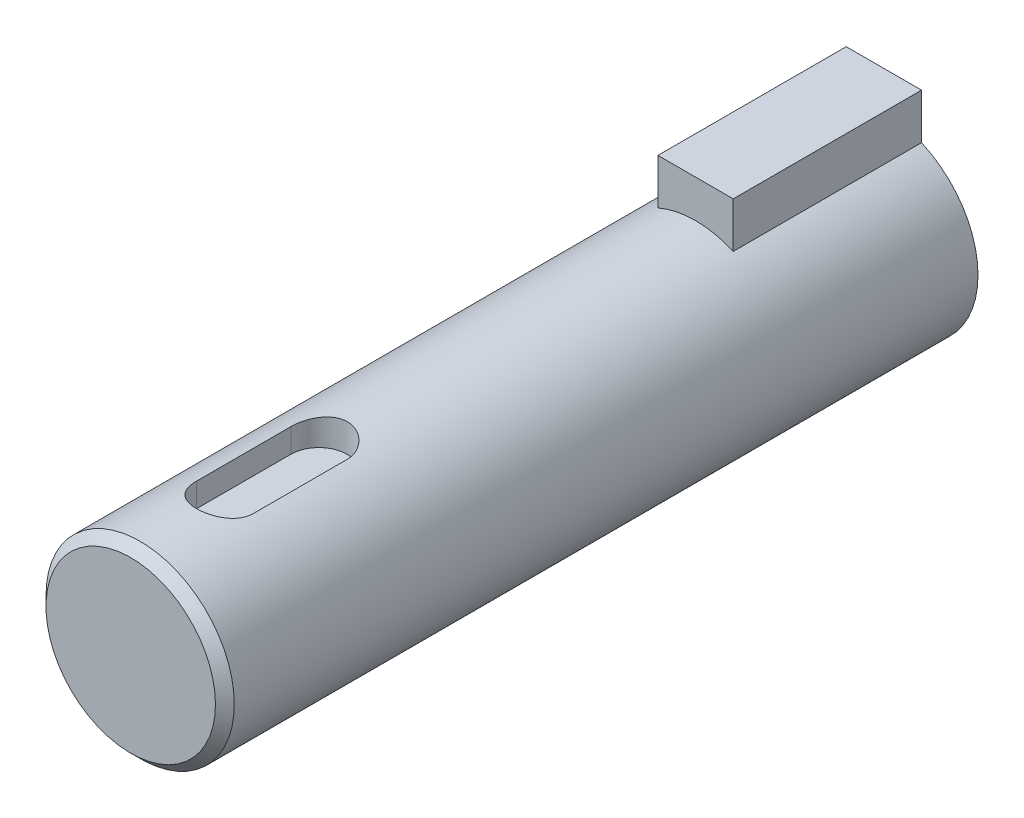
ISO-10303-21;
HEADER;
FILE_DESCRIPTION(('STEP AP214'),'2;1');
FILE_NAME('part.step','',(''),(''),'','','');
FILE_SCHEMA(('AUTOMOTIVE_DESIGN { 1 0 10303 214 1 1 1 1 }'));
ENDSEC;
DATA;
#1=APPLICATION_CONTEXT('core data for automotive mechanical design processes');
#2=APPLICATION_PROTOCOL_DEFINITION('international standard','automotive_design',2000,#1);
#3=PRODUCT_CONTEXT('',#1,'mechanical');
#4=PRODUCT('Part','Part','',(#3));
#5=PRODUCT_RELATED_PRODUCT_CATEGORY('part','',(#4));
#6=PRODUCT_DEFINITION_FORMATION('','',#4);
#7=PRODUCT_DEFINITION_CONTEXT('part definition',#1,'design');
#8=PRODUCT_DEFINITION('design','',#6,#7);
#9=PRODUCT_DEFINITION_SHAPE('','',#8);
#10=(LENGTH_UNIT() NAMED_UNIT(*) SI_UNIT(.MILLI.,.METRE.));
#11=(NAMED_UNIT(*) PLANE_ANGLE_UNIT() SI_UNIT($,.RADIAN.));
#12=(NAMED_UNIT(*) SI_UNIT($,.STERADIAN.) SOLID_ANGLE_UNIT());
#13=UNCERTAINTY_MEASURE_WITH_UNIT(LENGTH_MEASURE(1.E-05),#10,'distance_accuracy_value','');
#14=(GEOMETRIC_REPRESENTATION_CONTEXT(3) GLOBAL_UNCERTAINTY_ASSIGNED_CONTEXT((#13)) GLOBAL_UNIT_ASSIGNED_CONTEXT((#10,
#11,#12)) REPRESENTATION_CONTEXT('',''));
#15=CARTESIAN_POINT('',(0.,0.,0.));
#16=DIRECTION('',(0.,0.,1.));
#17=DIRECTION('',(1.,0.,0.));
#18=AXIS2_PLACEMENT_3D('',#15,#16,#17);
#19=CARTESIAN_POINT('',(0.,0.,10.));
#20=DIRECTION('',(0.,0.,-1.));
#21=DIRECTION('',(-1.,0.,0.));
#22=AXIS2_PLACEMENT_3D('',#19,#20,#21);
#23=CYLINDRICAL_SURFACE('',#22,5.);
#24=CARTESIAN_POINT('',(0.,0.,39.5));
#25=DIRECTION('',(0.,0.,1.));
#26=DIRECTION('',(1.,0.,0.));
#27=AXIS2_PLACEMENT_3D('',#24,#25,#26);
#28=CIRCLE('',#27,5.);
#29=CARTESIAN_POINT('',(5.,0.,39.5));
#30=VERTEX_POINT('',#29);
#31=EDGE_CURVE('E11',#30,#30,#28,.F.);
#32=ORIENTED_EDGE('',*,*,#31,.T.);
#33=EDGE_LOOP('',(#32));
#34=FACE_BOUND('',#33,.T.);
#35=CARTESIAN_POINT('',(0.,0.,0.));
#36=DIRECTION('',(0.,0.,1.));
#37=DIRECTION('',(1.,0.,0.));
#38=AXIS2_PLACEMENT_3D('',#35,#36,#37);
#39=CIRCLE('',#38,5.);
#40=CARTESIAN_POINT('',(-2.,4.58257569495584,0.));
#41=VERTEX_POINT('',#40);
#42=CARTESIAN_POINT('',(2.,4.58257569495584,0.));
#43=VERTEX_POINT('',#42);
#44=EDGE_CURVE('E147',#41,#43,#39,.T.);
#45=ORIENTED_EDGE('',*,*,#44,.T.);
#46=DIRECTION('',(0.,0.,-1.));
#47=VECTOR('',#46,1.);
#48=CARTESIAN_POINT('',(2.,4.58257569495584,10.));
#49=LINE('',#48,#47);
#50=CARTESIAN_POINT('',(2.,4.58257569495584,10.));
#51=VERTEX_POINT('',#50);
#52=EDGE_CURVE('E166',#51,#43,#49,.T.);
#53=ORIENTED_EDGE('',*,*,#52,.F.);
#54=CARTESIAN_POINT('',(0.,0.,10.));
#55=DIRECTION('',(0.,0.,1.));
#56=DIRECTION('',(1.,0.,0.));
#57=AXIS2_PLACEMENT_3D('',#54,#55,#56);
#58=CIRCLE('',#57,5.);
#59=CARTESIAN_POINT('',(-2.,4.58257569495584,10.));
#60=VERTEX_POINT('',#59);
#61=EDGE_CURVE('E122',#51,#60,#58,.T.);
#62=ORIENTED_EDGE('',*,*,#61,.T.);
#63=DIRECTION('',(0.,0.,-1.));
#64=VECTOR('',#63,1.);
#65=CARTESIAN_POINT('',(-2.,4.58257569495584,10.));
#66=LINE('',#65,#64);
#67=EDGE_CURVE('E152',#60,#41,#66,.T.);
#68=ORIENTED_EDGE('',*,*,#67,.T.);
#69=EDGE_LOOP('',(#45,#53,#62,#68));
#70=FACE_BOUND('',#69,.T.);
#71=CARTESIAN_POINT('',(-1.5,4.76969600708473,35.));
#72=CARTESIAN_POINT('',(-1.50000085357071,4.76969249084934,35.041179392908));
#73=CARTESIAN_POINT('',(-1.49830317083428,4.77022997000129,35.0823380431261));
#74=CARTESIAN_POINT('',(-1.49153785660317,4.77235095109999,35.1643411620956));
#75=CARTESIAN_POINT('',(-1.48647098275841,4.77393421787376,35.2051856993949));
#76=CARTESIAN_POINT('',(-1.46630203689311,4.78018490618873,35.3265905409547));
#77=CARTESIAN_POINT('',(-1.44623120413662,4.78635370384275,35.4063063904164));
#78=CARTESIAN_POINT('',(-1.39353102315626,4.80195952113208,35.5610355783859));
#79=CARTESIAN_POINT('',(-1.36090607068203,4.81139539670393,35.6360505521981));
#80=CARTESIAN_POINT('',(-1.28407841117656,4.83246571212052,35.7795966815976));
#81=CARTESIAN_POINT('',(-1.23987031651226,4.84410117434933,35.8481247997284));
#82=CARTESIAN_POINT('',(-1.13964850658326,4.86866835244721,35.9788660559971));
#83=CARTESIAN_POINT('',(-1.08333433465208,4.88162755412974,36.0408436603434));
#84=CARTESIAN_POINT('',(-0.961138919873354,4.90714811559049,36.1546355839));
#85=CARTESIAN_POINT('',(-0.895256063916348,4.91970940785249,36.2064481860031));
#86=CARTESIAN_POINT('',(-0.754109921315429,4.94333239727705,36.2994637703185));
#87=CARTESIAN_POINT('',(-0.678680819336258,4.95435770971354,36.340425180298));
#88=CARTESIAN_POINT('',(-0.521621185505772,4.97334469846208,36.4089884116182));
#89=CARTESIAN_POINT('',(-0.439992259012925,4.98130716463903,36.4365936777943));
#90=CARTESIAN_POINT('',(-0.275324697874876,4.99307639935002,36.4768797991021));
#91=CARTESIAN_POINT('',(-0.192393125294251,4.99699549276993,36.4899648579698));
#92=CARTESIAN_POINT('',(-0.0254235719980804,5.00063202022426,36.5021173413633));
#93=CARTESIAN_POINT('',(0.0586141962423635,5.00035024971471,36.5011874197002));
#94=CARTESIAN_POINT('',(0.222571599946017,4.99569602566267,36.485607091241));
#95=CARTESIAN_POINT('',(0.302537145464641,4.99145415509187,36.4713946550213));
#96=CARTESIAN_POINT('',(0.458890052102025,4.9795151369998,36.4303683647619));
#97=CARTESIAN_POINT('',(0.535277225531998,4.97181780846028,36.4035538505441));
#98=CARTESIAN_POINT('',(0.683347815892216,4.95365214926145,36.3377877783536));
#99=CARTESIAN_POINT('',(0.754966006044142,4.94315255692525,36.2986983556431));
#100=CARTESIAN_POINT('',(0.89076552957442,4.92049624651755,36.2096014099517));
#101=CARTESIAN_POINT('',(0.954945191614595,4.90833915735884,36.1595914405212));
#102=CARTESIAN_POINT('',(1.07665450541275,4.88311673571409,36.0478080119165));
#103=CARTESIAN_POINT('',(1.13383351478034,4.87003445449554,35.9856561362393));
#104=CARTESIAN_POINT('',(1.23706769492487,4.84484215114658,35.8525025765721));
#105=CARTESIAN_POINT('',(1.28311962013077,4.83273241337565,35.7814983196345));
#106=CARTESIAN_POINT('',(1.36316407240863,4.81077228795653,35.6317190715507));
#107=CARTESIAN_POINT('',(1.39703006341135,4.80094596245948,35.5528728204066));
#108=CARTESIAN_POINT('',(1.45085886004699,4.78495663653201,35.3902754960183));
#109=CARTESIAN_POINT('',(1.47084293218035,4.77878803475875,35.3065321392856));
#110=CARTESIAN_POINT('',(1.4890120359008,4.77314032325006,35.1850051109298));
#111=CARTESIAN_POINT('',(1.49313202989009,4.77185156275267,35.1481092658204));
#112=CARTESIAN_POINT('',(1.49862355614854,4.77012928611782,35.0741485209005));
#113=CARTESIAN_POINT('',(1.49999912968269,4.76969451246644,35.0370839503361));
#114=CARTESIAN_POINT('',(1.5,4.76969600708473,35.));
#115=B_SPLINE_CURVE_WITH_KNOTS('',3,(#71,#72,#73,#74,#75,#76,#77,#78,#79,#80,#81,#82,#83,#84,
#85,#86,#87,#88,#89,#90,#91,#92,#93,#94,#95,#96,#97,#98,#99,#100,#101,#102,#103,#104,#105,#106,
#107,#108,#109,#110,#111,#112,#113,#114),.UNSPECIFIED.,.F.,.F.,(4,2,2,2,2,2,2,2,2,2,2,2,2,2,2,2,
2,2,2,2,2,4),(0.,0.123459071219744,0.246890388853047,0.492911349615211,0.738846245884322,
0.984895736828089,1.23795510798803,1.49105719006936,1.74939356197455,2.00766326783256,
2.25854751319802,2.5093842528947,2.75223130012966,2.99509107067836,3.2407824256273,
3.48652887757005,3.74172568310981,3.99699683536778,4.25484698071527,4.51230123440207,
4.62365084745809,4.73483637253616),.UNSPECIFIED.);
#116=CARTESIAN_POINT('',(-1.5,4.76969600708473,35.));
#117=VERTEX_POINT('',#116);
#118=CARTESIAN_POINT('',(1.5,4.76969600708473,35.));
#119=VERTEX_POINT('',#118);
#120=EDGE_CURVE('E119',#117,#119,#115,.T.);
#121=ORIENTED_EDGE('',*,*,#120,.F.);
#122=DIRECTION('',(0.,0.,-1.));
#123=VECTOR('',#122,1.);
#124=CARTESIAN_POINT('',(-1.5,4.76969600708473,10.));
#125=LINE('',#124,#123);
#126=CARTESIAN_POINT('',(-1.5,4.76969600708473,30.));
#127=VERTEX_POINT('',#126);
#128=EDGE_CURVE('E169',#127,#117,#125,.F.);
#129=ORIENTED_EDGE('',*,*,#128,.F.);
#130=CARTESIAN_POINT('',(1.5,4.76969600708473,30.));
#131=CARTESIAN_POINT('',(1.50000085357071,4.76969249084934,29.958820607092));
#132=CARTESIAN_POINT('',(1.49830317083428,4.77022997000129,29.9176619568739));
#133=CARTESIAN_POINT('',(1.49153785660317,4.77235095109999,29.8356588379044));
#134=CARTESIAN_POINT('',(1.48647098275841,4.77393421787376,29.7948143006051));
#135=CARTESIAN_POINT('',(1.46630203689311,4.78018490618873,29.6734094590453));
#136=CARTESIAN_POINT('',(1.44623120413662,4.78635370384275,29.5936936095836));
#137=CARTESIAN_POINT('',(1.39353102315626,4.80195952113208,29.4389644216141));
#138=CARTESIAN_POINT('',(1.36090607068203,4.81139539670393,29.3639494478019));
#139=CARTESIAN_POINT('',(1.28407841117655,4.83246571212052,29.2204033184024));
#140=CARTESIAN_POINT('',(1.23987031651226,4.84410117434933,29.1518752002716));
#141=CARTESIAN_POINT('',(1.13964850658326,4.86866835244721,29.021133944003));
#142=CARTESIAN_POINT('',(1.08333433465208,4.88162755412974,28.9591563396566));
#143=CARTESIAN_POINT('',(0.961138919873354,4.90714811559049,28.8453644161));
#144=CARTESIAN_POINT('',(0.895256063916348,4.91970940785249,28.7935518139969));
#145=CARTESIAN_POINT('',(0.75410992131543,4.94333239727705,28.7005362296815));
#146=CARTESIAN_POINT('',(0.678680819336259,4.95435770971354,28.6595748197021));
#147=CARTESIAN_POINT('',(0.521621185505774,4.97334469846208,28.5910115883818));
#148=CARTESIAN_POINT('',(0.439992259012926,4.98130716463903,28.5634063222057));
#149=CARTESIAN_POINT('',(0.275324697874877,4.99307639935002,28.523120200898));
#150=CARTESIAN_POINT('',(0.192393125294253,4.99699549276993,28.5100351420303));
#151=CARTESIAN_POINT('',(0.0254235719980812,5.00063202022426,28.4978826586367));
#152=CARTESIAN_POINT('',(-0.0586141962423629,5.00035024971471,28.4988125802998));
#153=CARTESIAN_POINT('',(-0.222571599946017,4.99569602566267,28.514392908759));
#154=CARTESIAN_POINT('',(-0.302537145464641,4.99145415509187,28.5286053449787));
#155=CARTESIAN_POINT('',(-0.458890052102026,4.9795151369998,28.5696316352381));
#156=CARTESIAN_POINT('',(-0.535277225531999,4.97181780846028,28.5964461494559));
#157=CARTESIAN_POINT('',(-0.683347815892217,4.95365214926145,28.6622122216464));
#158=CARTESIAN_POINT('',(-0.754966006044143,4.94315255692525,28.7013016443569));
#159=CARTESIAN_POINT('',(-0.890765529574421,4.92049624651755,28.7903985900483));
#160=CARTESIAN_POINT('',(-0.954945191614596,4.90833915735884,28.8404085594788));
#161=CARTESIAN_POINT('',(-1.07665450541275,4.88311673571409,28.9521919880835));
#162=CARTESIAN_POINT('',(-1.13383351478034,4.87003445449553,29.0143438637607));
#163=CARTESIAN_POINT('',(-1.23706769492487,4.84484215114658,29.1474974234279));
#164=CARTESIAN_POINT('',(-1.28311962013078,4.83273241337565,29.2185016803655));
#165=CARTESIAN_POINT('',(-1.36316407240863,4.81077228795653,29.3682809284493));
#166=CARTESIAN_POINT('',(-1.39703006341135,4.80094596245948,29.4471271795934));
#167=CARTESIAN_POINT('',(-1.45085886004699,4.78495663653201,29.6097245039817));
#168=CARTESIAN_POINT('',(-1.47084293218035,4.77878803475875,29.6934678607144));
#169=CARTESIAN_POINT('',(-1.4890120359008,4.77314032325006,29.8149948890702));
#170=CARTESIAN_POINT('',(-1.49313202989009,4.77185156275267,29.8518907341796));
#171=CARTESIAN_POINT('',(-1.49862355614854,4.77012928611782,29.9258514790995));
#172=CARTESIAN_POINT('',(-1.49999912968269,4.76969451246644,29.9629160496639));
#173=CARTESIAN_POINT('',(-1.5,4.76969600708473,30.));
#174=B_SPLINE_CURVE_WITH_KNOTS('',3,(#130,#131,#132,#133,#134,#135,#136,#137,#138,#139,#140,
#141,#142,#143,#144,#145,#146,#147,#148,#149,#150,#151,#152,#153,#154,#155,#156,#157,#158,#159,
#160,#161,#162,#163,#164,#165,#166,#167,#168,#169,#170,#171,#172,#173),.UNSPECIFIED.,.F.,.F.,(4,
2,2,2,2,2,2,2,2,2,2,2,2,2,2,2,2,2,2,2,2,4),(0.,0.123459071219737,0.246890388853047,
0.492911349615211,0.73884624588433,0.984895736828095,1.23795510798803,1.49105719006936,
1.74939356197455,2.00766326783256,2.25854751319802,2.5093842528947,2.75223130012966,
2.99509107067836,3.2407824256273,3.48652887757005,3.74172568310981,3.99699683536777,
4.25484698071527,4.51230123440207,4.62365084745809,4.73483637253615),.UNSPECIFIED.);
#175=CARTESIAN_POINT('',(1.5,4.76969600708473,30.));
#176=VERTEX_POINT('',#175);
#177=EDGE_CURVE('E171',#176,#127,#174,.T.);
#178=ORIENTED_EDGE('',*,*,#177,.F.);
#179=DIRECTION('',(0.,0.,-1.));
#180=VECTOR('',#179,1.);
#181=CARTESIAN_POINT('',(1.5,4.76969600708473,10.));
#182=LINE('',#181,#180);
#183=EDGE_CURVE('E178',#119,#176,#182,.T.);
#184=ORIENTED_EDGE('',*,*,#183,.F.);
#185=EDGE_LOOP('',(#121,#129,#178,#184));
#186=FACE_BOUND('',#185,.T.);
#187=ADVANCED_FACE('F37',(#34,#70,#186),#23,.T.);
#188=CARTESIAN_POINT('',(2.,7.,10.));
#189=DIRECTION('',(-1.,0.,0.));
#190=DIRECTION('',(0.,0.,1.));
#191=AXIS2_PLACEMENT_3D('',#188,#189,#190);
#192=PLANE('',#191);
#193=DIRECTION('',(0.,1.,0.));
#194=VECTOR('',#193,1.);
#195=CARTESIAN_POINT('',(2.,7.,0.));
#196=LINE('',#195,#194);
#197=CARTESIAN_POINT('',(2.,7.,0.));
#198=VERTEX_POINT('',#197);
#199=EDGE_CURVE('E155',#43,#198,#196,.T.);
#200=ORIENTED_EDGE('',*,*,#199,.T.);
#201=DIRECTION('',(0.,0.,-1.));
#202=VECTOR('',#201,1.);
#203=CARTESIAN_POINT('',(2.,7.,10.));
#204=LINE('',#203,#202);
#205=CARTESIAN_POINT('',(2.,7.,10.));
#206=VERTEX_POINT('',#205);
#207=EDGE_CURVE('E163',#206,#198,#204,.T.);
#208=ORIENTED_EDGE('',*,*,#207,.F.);
#209=DIRECTION('',(0.,1.,0.));
#210=VECTOR('',#209,1.);
#211=CARTESIAN_POINT('',(2.,7.,10.));
#212=LINE('',#211,#210);
#213=EDGE_CURVE('E86',#51,#206,#212,.T.);
#214=ORIENTED_EDGE('',*,*,#213,.F.);
#215=ORIENTED_EDGE('',*,*,#52,.T.);
#216=EDGE_LOOP('',(#200,#208,#214,#215));
#217=FACE_BOUND('',#216,.T.);
#218=ADVANCED_FACE('F212',(#217),#192,.F.);
#219=CARTESIAN_POINT('',(-2.,7.,10.));
#220=DIRECTION('',(0.,-1.,0.));
#221=DIRECTION('',(0.,0.,-1.));
#222=AXIS2_PLACEMENT_3D('',#219,#220,#221);
#223=PLANE('',#222);
#224=DIRECTION('',(-1.,0.,0.));
#225=VECTOR('',#224,1.);
#226=CARTESIAN_POINT('',(-2.,7.,0.));
#227=LINE('',#226,#225);
#228=CARTESIAN_POINT('',(-2.,7.,0.));
#229=VERTEX_POINT('',#228);
#230=EDGE_CURVE('E157',#198,#229,#227,.T.);
#231=ORIENTED_EDGE('',*,*,#230,.T.);
#232=DIRECTION('',(0.,0.,-1.));
#233=VECTOR('',#232,1.);
#234=CARTESIAN_POINT('',(-2.,7.,10.));
#235=LINE('',#234,#233);
#236=CARTESIAN_POINT('',(-2.,7.,10.));
#237=VERTEX_POINT('',#236);
#238=EDGE_CURVE('E161',#237,#229,#235,.T.);
#239=ORIENTED_EDGE('',*,*,#238,.F.);
#240=DIRECTION('',(-1.,0.,0.));
#241=VECTOR('',#240,1.);
#242=CARTESIAN_POINT('',(-2.,7.,10.));
#243=LINE('',#242,#241);
#244=EDGE_CURVE('E149',#206,#237,#243,.T.);
#245=ORIENTED_EDGE('',*,*,#244,.F.);
#246=ORIENTED_EDGE('',*,*,#207,.T.);
#247=EDGE_LOOP('',(#231,#239,#245,#246));
#248=FACE_BOUND('',#247,.T.);
#249=ADVANCED_FACE('F217',(#248),#223,.F.);
#250=CARTESIAN_POINT('',(-2.,7.,10.));
#251=DIRECTION('',(1.,0.,0.));
#252=DIRECTION('',(0.,0.,-1.));
#253=AXIS2_PLACEMENT_3D('',#250,#251,#252);
#254=PLANE('',#253);
#255=DIRECTION('',(0.,-1.,0.));
#256=VECTOR('',#255,1.);
#257=CARTESIAN_POINT('',(-2.,7.,0.));
#258=LINE('',#257,#256);
#259=EDGE_CURVE('E82',#229,#41,#258,.T.);
#260=ORIENTED_EDGE('',*,*,#259,.T.);
#261=ORIENTED_EDGE('',*,*,#67,.F.);
#262=DIRECTION('',(0.,-1.,0.));
#263=VECTOR('',#262,1.);
#264=CARTESIAN_POINT('',(-2.,7.,10.));
#265=LINE('',#264,#263);
#266=EDGE_CURVE('E62',#237,#60,#265,.T.);
#267=ORIENTED_EDGE('',*,*,#266,.F.);
#268=ORIENTED_EDGE('',*,*,#238,.T.);
#269=EDGE_LOOP('',(#260,#261,#267,#268));
#270=FACE_BOUND('',#269,.T.);
#271=ADVANCED_FACE('F282',(#270),#254,.F.);
#272=CARTESIAN_POINT('',(0.,0.,10.));
#273=DIRECTION('',(0.,0.,1.));
#274=DIRECTION('',(1.,0.,0.));
#275=AXIS2_PLACEMENT_3D('',#272,#273,#274);
#276=PLANE('',#275);
#277=ORIENTED_EDGE('',*,*,#61,.F.);
#278=ORIENTED_EDGE('',*,*,#213,.T.);
#279=ORIENTED_EDGE('',*,*,#244,.T.);
#280=ORIENTED_EDGE('',*,*,#266,.T.);
#281=EDGE_LOOP('',(#277,#278,#279,#280));
#282=FACE_BOUND('',#281,.T.);
#283=ADVANCED_FACE('F278',(#282),#276,.T.);
#284=CARTESIAN_POINT('',(0.,0.,0.));
#285=DIRECTION('',(0.,0.,1.));
#286=DIRECTION('',(1.,0.,0.));
#287=AXIS2_PLACEMENT_3D('',#284,#285,#286);
#288=PLANE('',#287);
#289=ORIENTED_EDGE('',*,*,#44,.F.);
#290=ORIENTED_EDGE('',*,*,#259,.F.);
#291=ORIENTED_EDGE('',*,*,#230,.F.);
#292=ORIENTED_EDGE('',*,*,#199,.F.);
#293=EDGE_LOOP('',(#289,#290,#291,#292));
#294=FACE_BOUND('',#293,.T.);
#295=ADVANCED_FACE('F248',(#294),#288,.F.);
#296=CARTESIAN_POINT('',(0.,0.,40.));
#297=DIRECTION('',(0.,0.,1.));
#298=DIRECTION('',(1.,0.,0.));
#299=AXIS2_PLACEMENT_3D('',#296,#297,#298);
#300=PLANE('',#299);
#301=CARTESIAN_POINT('',(0.,0.,40.));
#302=DIRECTION('',(0.,0.,1.));
#303=DIRECTION('',(1.,0.,0.));
#304=AXIS2_PLACEMENT_3D('',#301,#302,#303);
#305=CIRCLE('',#304,4.5);
#306=CARTESIAN_POINT('',(4.5,0.,40.));
#307=VERTEX_POINT('',#306);
#308=EDGE_CURVE('E46',#307,#307,#305,.T.);
#309=ORIENTED_EDGE('',*,*,#308,.T.);
#310=EDGE_LOOP('',(#309));
#311=FACE_BOUND('',#310,.T.);
#312=ADVANCED_FACE('F195',(#311),#300,.T.);
#313=CARTESIAN_POINT('',(0.,7.,35.));
#314=DIRECTION('',(0.,-1.,0.));
#315=DIRECTION('',(0.,0.,-1.));
#316=AXIS2_PLACEMENT_3D('',#313,#314,#315);
#317=CYLINDRICAL_SURFACE('',#316,1.5);
#318=ORIENTED_EDGE('',*,*,#120,.T.);
#319=DIRECTION('',(0.,-1.,0.));
#320=VECTOR('',#319,1.);
#321=CARTESIAN_POINT('',(1.5,7.,35.));
#322=LINE('',#321,#320);
#323=CARTESIAN_POINT('',(1.5,3.5,35.));
#324=VERTEX_POINT('',#323);
#325=EDGE_CURVE('E112',#119,#324,#322,.T.);
#326=ORIENTED_EDGE('',*,*,#325,.T.);
#327=CARTESIAN_POINT('',(0.,3.5,35.));
#328=DIRECTION('',(0.,1.,0.));
#329=DIRECTION('',(0.,0.,1.));
#330=AXIS2_PLACEMENT_3D('',#327,#328,#329);
#331=CIRCLE('',#330,1.5);
#332=CARTESIAN_POINT('',(-1.5,3.5,35.));
#333=VERTEX_POINT('',#332);
#334=EDGE_CURVE('E117',#333,#324,#331,.T.);
#335=ORIENTED_EDGE('',*,*,#334,.F.);
#336=DIRECTION('',(0.,-1.,0.));
#337=VECTOR('',#336,1.);
#338=CARTESIAN_POINT('',(-1.5,7.,35.));
#339=LINE('',#338,#337);
#340=EDGE_CURVE('E141',#117,#333,#339,.T.);
#341=ORIENTED_EDGE('',*,*,#340,.F.);
#342=EDGE_LOOP('',(#318,#326,#335,#341));
#343=FACE_BOUND('',#342,.T.);
#344=ADVANCED_FACE('F114',(#343),#317,.F.);
#345=CARTESIAN_POINT('',(1.5,7.,35.));
#346=DIRECTION('',(-1.,0.,0.));
#347=DIRECTION('',(0.,0.,1.));
#348=AXIS2_PLACEMENT_3D('',#345,#346,#347);
#349=PLANE('',#348);
#350=ORIENTED_EDGE('',*,*,#183,.T.);
#351=DIRECTION('',(0.,-1.,0.));
#352=VECTOR('',#351,1.);
#353=CARTESIAN_POINT('',(1.5,7.,30.));
#354=LINE('',#353,#352);
#355=CARTESIAN_POINT('',(1.5,3.5,30.));
#356=VERTEX_POINT('',#355);
#357=EDGE_CURVE('E123',#176,#356,#354,.T.);
#358=ORIENTED_EDGE('',*,*,#357,.T.);
#359=DIRECTION('',(0.,0.,-1.));
#360=VECTOR('',#359,1.);
#361=CARTESIAN_POINT('',(1.5,3.5,35.));
#362=LINE('',#361,#360);
#363=EDGE_CURVE('E126',#324,#356,#362,.T.);
#364=ORIENTED_EDGE('',*,*,#363,.F.);
#365=ORIENTED_EDGE('',*,*,#325,.F.);
#366=EDGE_LOOP('',(#350,#358,#364,#365));
#367=FACE_BOUND('',#366,.T.);
#368=ADVANCED_FACE('F127',(#367),#349,.T.);
#369=CARTESIAN_POINT('',(0.,7.,30.));
#370=DIRECTION('',(0.,-1.,0.));
#371=DIRECTION('',(0.,0.,-1.));
#372=AXIS2_PLACEMENT_3D('',#369,#370,#371);
#373=CYLINDRICAL_SURFACE('',#372,1.5);
#374=ORIENTED_EDGE('',*,*,#177,.T.);
#375=DIRECTION('',(0.,-1.,0.));
#376=VECTOR('',#375,1.);
#377=CARTESIAN_POINT('',(-1.5,7.,30.));
#378=LINE('',#377,#376);
#379=CARTESIAN_POINT('',(-1.5,3.5,30.));
#380=VERTEX_POINT('',#379);
#381=EDGE_CURVE('E53',#127,#380,#378,.T.);
#382=ORIENTED_EDGE('',*,*,#381,.T.);
#383=CARTESIAN_POINT('',(0.,3.5,30.));
#384=DIRECTION('',(0.,1.,0.));
#385=DIRECTION('',(0.,0.,1.));
#386=AXIS2_PLACEMENT_3D('',#383,#384,#385);
#387=CIRCLE('',#386,1.5);
#388=EDGE_CURVE('E132',#356,#380,#387,.T.);
#389=ORIENTED_EDGE('',*,*,#388,.F.);
#390=ORIENTED_EDGE('',*,*,#357,.F.);
#391=EDGE_LOOP('',(#374,#382,#389,#390));
#392=FACE_BOUND('',#391,.T.);
#393=ADVANCED_FACE('F182',(#392),#373,.F.);
#394=CARTESIAN_POINT('',(-1.5,7.,35.));
#395=DIRECTION('',(1.,0.,0.));
#396=DIRECTION('',(0.,0.,-1.));
#397=AXIS2_PLACEMENT_3D('',#394,#395,#396);
#398=PLANE('',#397);
#399=ORIENTED_EDGE('',*,*,#128,.T.);
#400=ORIENTED_EDGE('',*,*,#340,.T.);
#401=DIRECTION('',(0.,0.,1.));
#402=VECTOR('',#401,1.);
#403=CARTESIAN_POINT('',(-1.5,3.5,35.));
#404=LINE('',#403,#402);
#405=EDGE_CURVE('E136',#380,#333,#404,.T.);
#406=ORIENTED_EDGE('',*,*,#405,.F.);
#407=ORIENTED_EDGE('',*,*,#381,.F.);
#408=EDGE_LOOP('',(#399,#400,#406,#407));
#409=FACE_BOUND('',#408,.T.);
#410=ADVANCED_FACE('F187',(#409),#398,.T.);
#411=CARTESIAN_POINT('',(0.,3.5,35.));
#412=DIRECTION('',(0.,1.,0.));
#413=DIRECTION('',(0.,0.,1.));
#414=AXIS2_PLACEMENT_3D('',#411,#412,#413);
#415=PLANE('',#414);
#416=ORIENTED_EDGE('',*,*,#334,.T.);
#417=ORIENTED_EDGE('',*,*,#363,.T.);
#418=ORIENTED_EDGE('',*,*,#388,.T.);
#419=ORIENTED_EDGE('',*,*,#405,.T.);
#420=EDGE_LOOP('',(#416,#417,#418,#419));
#421=FACE_BOUND('',#420,.T.);
#422=ADVANCED_FACE('F135',(#421),#415,.T.);
#423=CARTESIAN_POINT('',(0.,0.,40.));
#424=DIRECTION('',(0.,0.,-1.));
#425=DIRECTION('',(-1.,0.,0.));
#426=AXIS2_PLACEMENT_3D('',#423,#424,#425);
#427=CONICAL_SURFACE('',#426,4.5,0.785398163397457);
#428=ORIENTED_EDGE('',*,*,#31,.F.);
#429=EDGE_LOOP('',(#428));
#430=FACE_BOUND('',#429,.T.);
#431=ORIENTED_EDGE('',*,*,#308,.F.);
#432=EDGE_LOOP('',(#431));
#433=FACE_BOUND('',#432,.T.);
#434=ADVANCED_FACE('F40',(#430,#433),#427,.T.);
#435=CLOSED_SHELL('',(#187,#218,#249,#271,#283,#295,#312,#344,#368,#393,#410,#422,#434));
#436=MANIFOLD_SOLID_BREP('B2',#435);
#437=ADVANCED_BREP_SHAPE_REPRESENTATION('',(#18,#436),#14);
#438=SHAPE_DEFINITION_REPRESENTATION(#9,#437);
ENDSEC;
END-ISO-10303-21;
